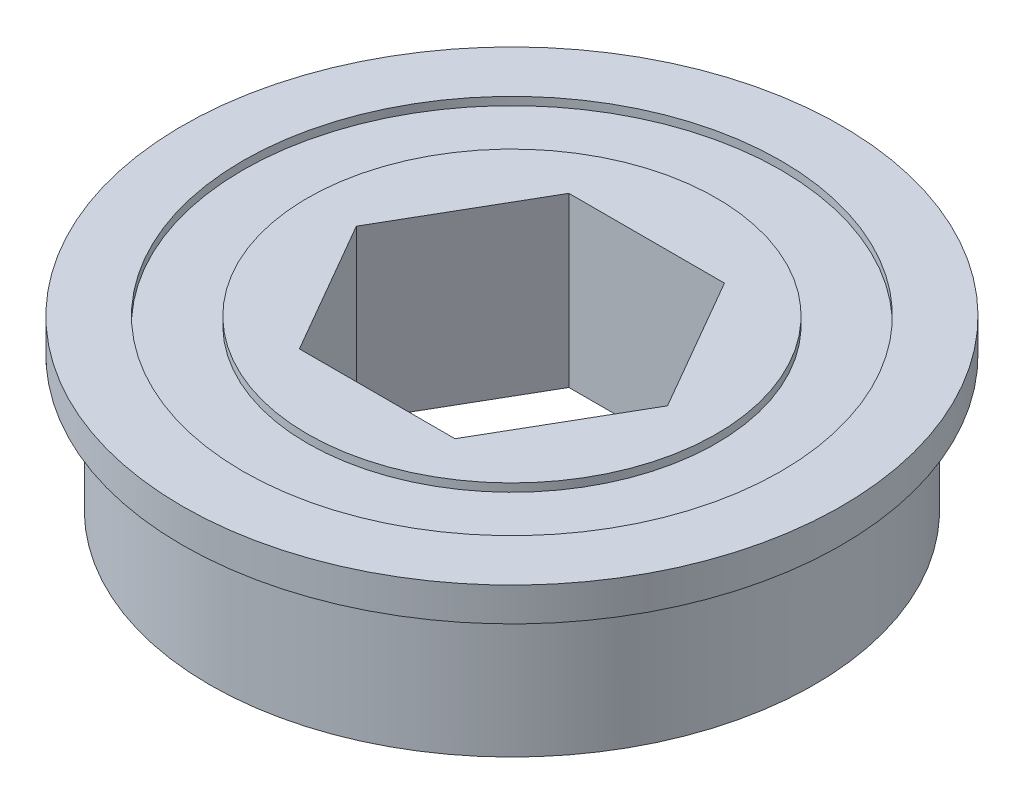
ISO-10303-21;
HEADER;
FILE_DESCRIPTION(('STEP AP214'),'2;1');
FILE_NAME('part.step','',(''),(''),'','','');
FILE_SCHEMA(('AUTOMOTIVE_DESIGN { 1 0 10303 214 1 1 1 1 }'));
ENDSEC;
DATA;
#1=APPLICATION_CONTEXT('core data for automotive mechanical design processes');
#2=APPLICATION_PROTOCOL_DEFINITION('international standard','automotive_design',2000,#1);
#3=PRODUCT_CONTEXT('',#1,'mechanical');
#4=PRODUCT('Part','Part','',(#3));
#5=PRODUCT_RELATED_PRODUCT_CATEGORY('part','',(#4));
#6=PRODUCT_DEFINITION_FORMATION('','',#4);
#7=PRODUCT_DEFINITION_CONTEXT('part definition',#1,'design');
#8=PRODUCT_DEFINITION('design','',#6,#7);
#9=PRODUCT_DEFINITION_SHAPE('','',#8);
#10=(LENGTH_UNIT() NAMED_UNIT(*) SI_UNIT(.MILLI.,.METRE.));
#11=(NAMED_UNIT(*) PLANE_ANGLE_UNIT() SI_UNIT($,.RADIAN.));
#12=(NAMED_UNIT(*) SI_UNIT($,.STERADIAN.) SOLID_ANGLE_UNIT());
#13=UNCERTAINTY_MEASURE_WITH_UNIT(LENGTH_MEASURE(1.E-05),#10,'distance_accuracy_value','');
#14=(GEOMETRIC_REPRESENTATION_CONTEXT(3) GLOBAL_UNCERTAINTY_ASSIGNED_CONTEXT((#13)) GLOBAL_UNIT_ASSIGNED_CONTEXT((#10,
#11,#12)) REPRESENTATION_CONTEXT('',''));
#15=CARTESIAN_POINT('',(0.,0.,0.));
#16=DIRECTION('',(0.,0.,1.));
#17=DIRECTION('',(1.,0.,0.));
#18=AXIS2_PLACEMENT_3D('',#15,#16,#17);
#19=CARTESIAN_POINT('',(0.,0.,0.));
#20=DIRECTION('',(0.,1.,0.));
#21=DIRECTION('',(0.,0.,1.));
#22=AXIS2_PLACEMENT_3D('',#19,#20,#21);
#23=CYLINDRICAL_SURFACE('',#22,12.7);
#24=CARTESIAN_POINT('',(0.,0.381,0.));
#25=DIRECTION('',(0.,1.,0.));
#26=DIRECTION('',(0.,0.,1.));
#27=AXIS2_PLACEMENT_3D('',#24,#25,#26);
#28=CIRCLE('',#27,12.7);
#29=CARTESIAN_POINT('',(0.,0.381,12.7));
#30=VERTEX_POINT('',#29);
#31=EDGE_CURVE('E128',#30,#30,#28,.F.);
#32=ORIENTED_EDGE('',*,*,#31,.F.);
#33=EDGE_LOOP('',(#32));
#34=FACE_BOUND('',#33,.T.);
#35=CARTESIAN_POINT('',(0.,0.,0.));
#36=DIRECTION('',(0.,1.,0.));
#37=DIRECTION('',(0.,0.,1.));
#38=AXIS2_PLACEMENT_3D('',#35,#36,#37);
#39=CIRCLE('',#38,12.7);
#40=CARTESIAN_POINT('',(0.,0.,12.7));
#41=VERTEX_POINT('',#40);
#42=EDGE_CURVE('E125',#41,#41,#39,.T.);
#43=ORIENTED_EDGE('',*,*,#42,.F.);
#44=EDGE_LOOP('',(#43));
#45=FACE_BOUND('',#44,.T.);
#46=ADVANCED_FACE('F16',(#34,#45),#23,.F.);
#47=CARTESIAN_POINT('',(9.652,0.381,0.));
#48=DIRECTION('',(0.,-1.,0.));
#49=DIRECTION('',(0.,0.,-1.));
#50=AXIS2_PLACEMENT_3D('',#47,#48,#49);
#51=PLANE('',#50);
#52=ORIENTED_EDGE('',*,*,#31,.T.);
#53=EDGE_LOOP('',(#52));
#54=FACE_BOUND('',#53,.T.);
#55=CARTESIAN_POINT('',(0.,0.381,0.));
#56=DIRECTION('',(0.,1.,0.));
#57=DIRECTION('',(0.,0.,1.));
#58=AXIS2_PLACEMENT_3D('',#55,#56,#57);
#59=CIRCLE('',#58,9.652);
#60=CARTESIAN_POINT('',(0.,0.381,9.652));
#61=VERTEX_POINT('',#60);
#62=EDGE_CURVE('E122',#61,#61,#59,.F.);
#63=ORIENTED_EDGE('',*,*,#62,.F.);
#64=EDGE_LOOP('',(#63));
#65=FACE_BOUND('',#64,.T.);
#66=ADVANCED_FACE('F357',(#54,#65),#51,.T.);
#67=CARTESIAN_POINT('',(14.2748,0.,0.));
#68=DIRECTION('',(0.,-1.,0.));
#69=DIRECTION('',(0.,0.,-1.));
#70=AXIS2_PLACEMENT_3D('',#67,#68,#69);
#71=PLANE('',#70);
#72=CARTESIAN_POINT('',(0.,0.,0.));
#73=DIRECTION('',(0.,1.,0.));
#74=DIRECTION('',(0.,0.,1.));
#75=AXIS2_PLACEMENT_3D('',#72,#73,#74);
#76=CIRCLE('',#75,14.2748);
#77=CARTESIAN_POINT('',(0.,0.,14.2748));
#78=VERTEX_POINT('',#77);
#79=EDGE_CURVE('E119',#78,#78,#76,.T.);
#80=ORIENTED_EDGE('',*,*,#79,.F.);
#81=EDGE_LOOP('',(#80));
#82=FACE_BOUND('',#81,.T.);
#83=ORIENTED_EDGE('',*,*,#42,.T.);
#84=EDGE_LOOP('',(#83));
#85=FACE_BOUND('',#84,.T.);
#86=ADVANCED_FACE('F347',(#82,#85),#71,.T.);
#87=CARTESIAN_POINT('',(0.,0.,0.));
#88=DIRECTION('',(0.,1.,0.));
#89=DIRECTION('',(0.,0.,1.));
#90=AXIS2_PLACEMENT_3D('',#87,#88,#89);
#91=CYLINDRICAL_SURFACE('',#90,9.652);
#92=CARTESIAN_POINT('',(0.,0.,0.));
#93=DIRECTION('',(0.,1.,0.));
#94=DIRECTION('',(0.,0.,1.));
#95=AXIS2_PLACEMENT_3D('',#92,#93,#94);
#96=CIRCLE('',#95,9.652);
#97=CARTESIAN_POINT('',(0.,0.,9.652));
#98=VERTEX_POINT('',#97);
#99=EDGE_CURVE('E99',#98,#98,#96,.F.);
#100=ORIENTED_EDGE('',*,*,#99,.F.);
#101=EDGE_LOOP('',(#100));
#102=FACE_BOUND('',#101,.T.);
#103=ORIENTED_EDGE('',*,*,#62,.T.);
#104=EDGE_LOOP('',(#103));
#105=FACE_BOUND('',#104,.T.);
#106=ADVANCED_FACE('F337',(#102,#105),#91,.T.);
#107=CARTESIAN_POINT('',(0.,0.,0.));
#108=DIRECTION('',(0.,1.,0.));
#109=DIRECTION('',(0.,0.,1.));
#110=AXIS2_PLACEMENT_3D('',#107,#108,#109);
#111=CYLINDRICAL_SURFACE('',#110,14.2748);
#112=ORIENTED_EDGE('',*,*,#79,.T.);
#113=EDGE_LOOP('',(#112));
#114=FACE_BOUND('',#113,.T.);
#115=CARTESIAN_POINT('',(0.,5.6,0.));
#116=DIRECTION('',(0.,-1.,0.));
#117=DIRECTION('',(0.,0.,-1.));
#118=AXIS2_PLACEMENT_3D('',#115,#116,#117);
#119=CIRCLE('',#118,14.2748);
#120=CARTESIAN_POINT('',(0.,5.6,-14.2748));
#121=VERTEX_POINT('',#120);
#122=EDGE_CURVE('E82',#121,#121,#119,.F.);
#123=ORIENTED_EDGE('',*,*,#122,.F.);
#124=EDGE_LOOP('',(#123));
#125=FACE_BOUND('',#124,.T.);
#126=ADVANCED_FACE('F327',(#114,#125),#111,.T.);
#127=CARTESIAN_POINT('',(9.652,0.,0.));
#128=DIRECTION('',(0.,-1.,0.));
#129=DIRECTION('',(0.,0.,-1.));
#130=AXIS2_PLACEMENT_3D('',#127,#128,#129);
#131=PLANE('',#130);
#132=ORIENTED_EDGE('',*,*,#99,.T.);
#133=EDGE_LOOP('',(#132));
#134=FACE_BOUND('',#133,.T.);
#135=DIRECTION('',(1.,0.,0.));
#136=VECTOR('',#135,1.);
#137=CARTESIAN_POINT('',(-3.67194771204601,0.,6.36));
#138=LINE('',#137,#136);
#139=CARTESIAN_POINT('',(-3.67194771204601,0.,6.36));
#140=VERTEX_POINT('',#139);
#141=CARTESIAN_POINT('',(3.67194771204602,0.,6.36));
#142=VERTEX_POINT('',#141);
#143=EDGE_CURVE('E61',#140,#142,#138,.T.);
#144=ORIENTED_EDGE('',*,*,#143,.T.);
#145=DIRECTION('',(0.5,0.,-0.866025403784439));
#146=VECTOR('',#145,1.);
#147=CARTESIAN_POINT('',(3.67194771204602,0.,6.36));
#148=LINE('',#147,#146);
#149=CARTESIAN_POINT('',(7.34389542409204,0.,0.));
#150=VERTEX_POINT('',#149);
#151=EDGE_CURVE('E63',#142,#150,#148,.T.);
#152=ORIENTED_EDGE('',*,*,#151,.T.);
#153=DIRECTION('',(-0.5,0.,-0.866025403784439));
#154=VECTOR('',#153,1.);
#155=CARTESIAN_POINT('',(7.34389542409204,0.,0.));
#156=LINE('',#155,#154);
#157=CARTESIAN_POINT('',(3.67194771204602,0.,-6.36));
#158=VERTEX_POINT('',#157);
#159=EDGE_CURVE('E66',#150,#158,#156,.T.);
#160=ORIENTED_EDGE('',*,*,#159,.T.);
#161=DIRECTION('',(-1.,0.,0.));
#162=VECTOR('',#161,1.);
#163=CARTESIAN_POINT('',(3.67194771204602,0.,-6.36));
#164=LINE('',#163,#162);
#165=CARTESIAN_POINT('',(-3.67194771204602,0.,-6.36));
#166=VERTEX_POINT('',#165);
#167=EDGE_CURVE('E191',#158,#166,#164,.T.);
#168=ORIENTED_EDGE('',*,*,#167,.T.);
#169=DIRECTION('',(-0.5,0.,0.866025403784439));
#170=VECTOR('',#169,1.);
#171=CARTESIAN_POINT('',(-3.67194771204602,0.,-6.36));
#172=LINE('',#171,#170);
#173=CARTESIAN_POINT('',(-7.34389542409204,0.,0.));
#174=VERTEX_POINT('',#173);
#175=EDGE_CURVE('E197',#166,#174,#172,.T.);
#176=ORIENTED_EDGE('',*,*,#175,.T.);
#177=DIRECTION('',(0.5,0.,0.866025403784439));
#178=VECTOR('',#177,1.);
#179=CARTESIAN_POINT('',(-7.34389542409204,0.,0.));
#180=LINE('',#179,#178);
#181=EDGE_CURVE('E202',#174,#140,#180,.T.);
#182=ORIENTED_EDGE('',*,*,#181,.T.);
#183=EDGE_LOOP('',(#144,#152,#160,#168,#176,#182));
#184=FACE_BOUND('',#183,.T.);
#185=ADVANCED_FACE('F65',(#134,#184),#131,.T.);
#186=CARTESIAN_POINT('',(0.,5.6,0.));
#187=DIRECTION('',(0.,-1.,0.));
#188=DIRECTION('',(0.,0.,-1.));
#189=AXIS2_PLACEMENT_3D('',#186,#187,#188);
#190=CONICAL_SURFACE('',#189,14.2748,0.523598775598298);
#191=CARTESIAN_POINT('',(0.,5.975,0.));
#192=DIRECTION('',(0.,1.,0.));
#193=DIRECTION('',(0.,0.,1.));
#194=AXIS2_PLACEMENT_3D('',#191,#192,#193);
#195=CIRCLE('',#194,14.0582936490539);
#196=CARTESIAN_POINT('',(0.,5.975,14.0582936490539));
#197=VERTEX_POINT('',#196);
#198=EDGE_CURVE('E93',#197,#197,#195,.F.);
#199=ORIENTED_EDGE('',*,*,#198,.T.);
#200=EDGE_LOOP('',(#199));
#201=FACE_BOUND('',#200,.T.);
#202=ORIENTED_EDGE('',*,*,#122,.T.);
#203=EDGE_LOOP('',(#202));
#204=FACE_BOUND('',#203,.T.);
#205=ADVANCED_FACE('F309',(#201,#204),#190,.T.);
#206=CARTESIAN_POINT('',(7.34389542409204,0.,0.));
#207=DIRECTION('',(0.866025403784439,0.,-0.5));
#208=DIRECTION('',(-0.5,0.,-0.866025403784439));
#209=AXIS2_PLACEMENT_3D('',#206,#207,#208);
#210=PLANE('',#209);
#211=DIRECTION('',(0.,1.,0.));
#212=VECTOR('',#211,1.);
#213=CARTESIAN_POINT('',(3.67194771204602,0.,-6.36));
#214=LINE('',#213,#212);
#215=CARTESIAN_POINT('',(3.67194771204602,7.9375,-6.36));
#216=VERTEX_POINT('',#215);
#217=EDGE_CURVE('E80',#216,#158,#214,.F.);
#218=ORIENTED_EDGE('',*,*,#217,.T.);
#219=ORIENTED_EDGE('',*,*,#159,.F.);
#220=DIRECTION('',(0.,1.,0.));
#221=VECTOR('',#220,1.);
#222=CARTESIAN_POINT('',(7.34389542409204,0.,0.));
#223=LINE('',#222,#221);
#224=CARTESIAN_POINT('',(7.34389542409204,7.9375,0.));
#225=VERTEX_POINT('',#224);
#226=EDGE_CURVE('E72',#150,#225,#223,.T.);
#227=ORIENTED_EDGE('',*,*,#226,.T.);
#228=DIRECTION('',(0.5,0.,0.866025403784438));
#229=VECTOR('',#228,1.);
#230=CARTESIAN_POINT('',(3.67194771204602,7.9375,-6.36));
#231=LINE('',#230,#229);
#232=EDGE_CURVE('E96',#216,#225,#231,.T.);
#233=ORIENTED_EDGE('',*,*,#232,.F.);
#234=EDGE_LOOP('',(#218,#219,#227,#233));
#235=FACE_BOUND('',#234,.T.);
#236=ADVANCED_FACE('F76',(#235),#210,.F.);
#237=CARTESIAN_POINT('',(3.67194771204602,0.,6.36));
#238=DIRECTION('',(0.866025403784439,0.,0.5));
#239=DIRECTION('',(0.5,0.,-0.866025403784439));
#240=AXIS2_PLACEMENT_3D('',#237,#238,#239);
#241=PLANE('',#240);
#242=ORIENTED_EDGE('',*,*,#226,.F.);
#243=ORIENTED_EDGE('',*,*,#151,.F.);
#244=DIRECTION('',(0.,1.,0.));
#245=VECTOR('',#244,1.);
#246=CARTESIAN_POINT('',(3.67194771204602,0.,6.36));
#247=LINE('',#246,#245);
#248=CARTESIAN_POINT('',(3.67194771204602,7.9375,6.36));
#249=VERTEX_POINT('',#248);
#250=EDGE_CURVE('E89',#142,#249,#247,.T.);
#251=ORIENTED_EDGE('',*,*,#250,.T.);
#252=DIRECTION('',(-0.5,0.,0.866025403784439));
#253=VECTOR('',#252,1.);
#254=CARTESIAN_POINT('',(7.34389542409204,7.9375,0.));
#255=LINE('',#254,#253);
#256=EDGE_CURVE('E86',#225,#249,#255,.T.);
#257=ORIENTED_EDGE('',*,*,#256,.F.);
#258=EDGE_LOOP('',(#242,#243,#251,#257));
#259=FACE_BOUND('',#258,.T.);
#260=ADVANCED_FACE('F84',(#259),#241,.F.);
#261=CARTESIAN_POINT('',(-3.67194771204601,0.,6.36));
#262=DIRECTION('',(0.,0.,1.));
#263=DIRECTION('',(1.,0.,0.));
#264=AXIS2_PLACEMENT_3D('',#261,#262,#263);
#265=PLANE('',#264);
#266=ORIENTED_EDGE('',*,*,#250,.F.);
#267=ORIENTED_EDGE('',*,*,#143,.F.);
#268=DIRECTION('',(0.,1.,0.));
#269=VECTOR('',#268,1.);
#270=CARTESIAN_POINT('',(-3.67194771204601,0.,6.36));
#271=LINE('',#270,#269);
#272=CARTESIAN_POINT('',(-3.67194771204601,7.9375,6.36));
#273=VERTEX_POINT('',#272);
#274=EDGE_CURVE('E199',#140,#273,#271,.T.);
#275=ORIENTED_EDGE('',*,*,#274,.T.);
#276=DIRECTION('',(1.,0.,0.));
#277=VECTOR('',#276,1.);
#278=CARTESIAN_POINT('',(6.35,7.9375,6.36));
#279=LINE('',#278,#277);
#280=EDGE_CURVE('E184',#249,#273,#279,.F.);
#281=ORIENTED_EDGE('',*,*,#280,.F.);
#282=EDGE_LOOP('',(#266,#267,#275,#281));
#283=FACE_BOUND('',#282,.T.);
#284=ADVANCED_FACE('F208',(#283),#265,.F.);
#285=CARTESIAN_POINT('',(-7.34389542409204,0.,0.));
#286=DIRECTION('',(-0.866025403784439,0.,0.5));
#287=DIRECTION('',(0.5,0.,0.866025403784439));
#288=AXIS2_PLACEMENT_3D('',#285,#286,#287);
#289=PLANE('',#288);
#290=ORIENTED_EDGE('',*,*,#274,.F.);
#291=ORIENTED_EDGE('',*,*,#181,.F.);
#292=DIRECTION('',(0.,1.,0.));
#293=VECTOR('',#292,1.);
#294=CARTESIAN_POINT('',(-7.34389542409204,0.,0.));
#295=LINE('',#294,#293);
#296=CARTESIAN_POINT('',(-7.34389542409204,7.9375,0.));
#297=VERTEX_POINT('',#296);
#298=EDGE_CURVE('E194',#174,#297,#295,.T.);
#299=ORIENTED_EDGE('',*,*,#298,.T.);
#300=DIRECTION('',(-0.5,0.,-0.866025403784439));
#301=VECTOR('',#300,1.);
#302=CARTESIAN_POINT('',(-3.67194771204601,7.9375,6.36));
#303=LINE('',#302,#301);
#304=EDGE_CURVE('E181',#273,#297,#303,.T.);
#305=ORIENTED_EDGE('',*,*,#304,.F.);
#306=EDGE_LOOP('',(#290,#291,#299,#305));
#307=FACE_BOUND('',#306,.T.);
#308=ADVANCED_FACE('F224',(#307),#289,.F.);
#309=CARTESIAN_POINT('',(-3.67194771204602,0.,-6.36));
#310=DIRECTION('',(-0.866025403784439,0.,-0.5));
#311=DIRECTION('',(-0.5,0.,0.866025403784439));
#312=AXIS2_PLACEMENT_3D('',#309,#310,#311);
#313=PLANE('',#312);
#314=ORIENTED_EDGE('',*,*,#298,.F.);
#315=ORIENTED_EDGE('',*,*,#175,.F.);
#316=DIRECTION('',(0.,1.,0.));
#317=VECTOR('',#316,1.);
#318=CARTESIAN_POINT('',(-3.67194771204602,0.,-6.36));
#319=LINE('',#318,#317);
#320=CARTESIAN_POINT('',(-3.67194771204602,7.9375,-6.36));
#321=VERTEX_POINT('',#320);
#322=EDGE_CURVE('E97',#166,#321,#319,.T.);
#323=ORIENTED_EDGE('',*,*,#322,.T.);
#324=DIRECTION('',(0.5,0.,-0.866025403784439));
#325=VECTOR('',#324,1.);
#326=CARTESIAN_POINT('',(-7.34389542409204,7.9375,0.));
#327=LINE('',#326,#325);
#328=EDGE_CURVE('E178',#297,#321,#327,.T.);
#329=ORIENTED_EDGE('',*,*,#328,.F.);
#330=EDGE_LOOP('',(#314,#315,#323,#329));
#331=FACE_BOUND('',#330,.T.);
#332=ADVANCED_FACE('F220',(#331),#313,.F.);
#333=CARTESIAN_POINT('',(3.67194771204602,0.,-6.36));
#334=DIRECTION('',(0.,0.,-1.));
#335=DIRECTION('',(-1.,0.,0.));
#336=AXIS2_PLACEMENT_3D('',#333,#334,#335);
#337=PLANE('',#336);
#338=ORIENTED_EDGE('',*,*,#322,.F.);
#339=ORIENTED_EDGE('',*,*,#167,.F.);
#340=ORIENTED_EDGE('',*,*,#217,.F.);
#341=DIRECTION('',(1.,0.,0.));
#342=VECTOR('',#341,1.);
#343=CARTESIAN_POINT('',(6.35,7.9375,-6.36));
#344=LINE('',#343,#342);
#345=EDGE_CURVE('E116',#321,#216,#344,.T.);
#346=ORIENTED_EDGE('',*,*,#345,.F.);
#347=EDGE_LOOP('',(#338,#339,#340,#346));
#348=FACE_BOUND('',#347,.T.);
#349=ADVANCED_FACE('F215',(#348),#337,.F.);
#350=CARTESIAN_POINT('',(6.35,7.9375,0.));
#351=DIRECTION('',(0.,1.,0.));
#352=DIRECTION('',(0.,0.,1.));
#353=AXIS2_PLACEMENT_3D('',#350,#351,#352);
#354=PLANE('',#353);
#355=CARTESIAN_POINT('',(0.,7.9375,0.));
#356=DIRECTION('',(0.,1.,0.));
#357=DIRECTION('',(0.,0.,1.));
#358=AXIS2_PLACEMENT_3D('',#355,#356,#357);
#359=CIRCLE('',#358,9.652);
#360=CARTESIAN_POINT('',(0.,7.9375,9.652));
#361=VERTEX_POINT('',#360);
#362=EDGE_CURVE('E112',#361,#361,#359,.F.);
#363=ORIENTED_EDGE('',*,*,#362,.F.);
#364=EDGE_LOOP('',(#363));
#365=FACE_BOUND('',#364,.T.);
#366=ORIENTED_EDGE('',*,*,#328,.T.);
#367=ORIENTED_EDGE('',*,*,#345,.T.);
#368=ORIENTED_EDGE('',*,*,#232,.T.);
#369=ORIENTED_EDGE('',*,*,#256,.T.);
#370=ORIENTED_EDGE('',*,*,#280,.T.);
#371=ORIENTED_EDGE('',*,*,#304,.T.);
#372=EDGE_LOOP('',(#366,#367,#368,#369,#370,#371));
#373=FACE_BOUND('',#372,.T.);
#374=ADVANCED_FACE('F163',(#365,#373),#354,.T.);
#375=CARTESIAN_POINT('',(0.,6.1,0.));
#376=DIRECTION('',(0.,1.,0.));
#377=DIRECTION('',(0.,0.,1.));
#378=AXIS2_PLACEMENT_3D('',#375,#376,#377);
#379=TOROIDAL_SURFACE('',#378,14.2748,0.25);
#380=ORIENTED_EDGE('',*,*,#198,.F.);
#381=EDGE_LOOP('',(#380));
#382=FACE_BOUND('',#381,.T.);
#383=CARTESIAN_POINT('',(0.,6.35,0.));
#384=DIRECTION('',(0.,-1.,0.));
#385=DIRECTION('',(0.,0.,-1.));
#386=AXIS2_PLACEMENT_3D('',#383,#384,#385);
#387=CIRCLE('',#386,14.2748);
#388=CARTESIAN_POINT('',(0.,6.35,14.2748));
#389=VERTEX_POINT('',#388);
#390=CARTESIAN_POINT('',(0.,6.35,-14.2748));
#391=VERTEX_POINT('',#390);
#392=EDGE_CURVE('E115',#389,#391,#387,.F.);
#393=ORIENTED_EDGE('',*,*,#392,.F.);
#394=CARTESIAN_POINT('',(0.,6.35,0.));
#395=DIRECTION('',(0.,-1.,0.));
#396=DIRECTION('',(0.,0.,1.));
#397=AXIS2_PLACEMENT_3D('',#394,#395,#396);
#398=CIRCLE('',#397,14.2748);
#399=EDGE_CURVE('E35',#391,#389,#398,.F.);
#400=ORIENTED_EDGE('',*,*,#399,.F.);
#401=EDGE_LOOP('',(#393,#400));
#402=FACE_BOUND('',#401,.T.);
#403=ADVANCED_FACE('F130',(#382,#402),#379,.F.);
#404=CARTESIAN_POINT('',(0.,0.,0.));
#405=DIRECTION('',(0.,1.,0.));
#406=DIRECTION('',(0.,0.,1.));
#407=AXIS2_PLACEMENT_3D('',#404,#405,#406);
#408=CYLINDRICAL_SURFACE('',#407,9.652);
#409=CARTESIAN_POINT('',(0.,7.5565,0.));
#410=DIRECTION('',(0.,1.,0.));
#411=DIRECTION('',(0.,0.,1.));
#412=AXIS2_PLACEMENT_3D('',#409,#410,#411);
#413=CIRCLE('',#412,9.652);
#414=CARTESIAN_POINT('',(0.,7.5565,9.652));
#415=VERTEX_POINT('',#414);
#416=EDGE_CURVE('E109',#415,#415,#413,.F.);
#417=ORIENTED_EDGE('',*,*,#416,.F.);
#418=EDGE_LOOP('',(#417));
#419=FACE_BOUND('',#418,.T.);
#420=ORIENTED_EDGE('',*,*,#362,.T.);
#421=EDGE_LOOP('',(#420));
#422=FACE_BOUND('',#421,.T.);
#423=ADVANCED_FACE('F154',(#419,#422),#408,.T.);
#424=CARTESIAN_POINT('',(15.5575,6.35,0.));
#425=DIRECTION('',(0.,-1.,0.));
#426=DIRECTION('',(0.,0.,-1.));
#427=AXIS2_PLACEMENT_3D('',#424,#425,#426);
#428=PLANE('',#427);
#429=CARTESIAN_POINT('',(0.,6.35,0.));
#430=DIRECTION('',(0.,1.,0.));
#431=DIRECTION('',(0.,0.,1.));
#432=AXIS2_PLACEMENT_3D('',#429,#430,#431);
#433=CIRCLE('',#432,15.5575);
#434=CARTESIAN_POINT('',(0.,6.35,15.5575));
#435=VERTEX_POINT('',#434);
#436=EDGE_CURVE('E106',#435,#435,#433,.T.);
#437=ORIENTED_EDGE('',*,*,#436,.F.);
#438=EDGE_LOOP('',(#437));
#439=FACE_BOUND('',#438,.T.);
#440=ORIENTED_EDGE('',*,*,#392,.T.);
#441=ORIENTED_EDGE('',*,*,#399,.T.);
#442=EDGE_LOOP('',(#440,#441));
#443=FACE_BOUND('',#442,.T.);
#444=ADVANCED_FACE('F134',(#439,#443),#428,.T.);
#445=CARTESIAN_POINT('',(9.652,7.5565,0.));
#446=DIRECTION('',(0.,1.,0.));
#447=DIRECTION('',(0.,0.,1.));
#448=AXIS2_PLACEMENT_3D('',#445,#446,#447);
#449=PLANE('',#448);
#450=ORIENTED_EDGE('',*,*,#416,.T.);
#451=EDGE_LOOP('',(#450));
#452=FACE_BOUND('',#451,.T.);
#453=CARTESIAN_POINT('',(0.,7.5565,0.));
#454=DIRECTION('',(0.,1.,0.));
#455=DIRECTION('',(0.,0.,1.));
#456=AXIS2_PLACEMENT_3D('',#453,#454,#455);
#457=CIRCLE('',#456,12.7);
#458=CARTESIAN_POINT('',(0.,7.5565,12.7));
#459=VERTEX_POINT('',#458);
#460=EDGE_CURVE('E103',#459,#459,#457,.T.);
#461=ORIENTED_EDGE('',*,*,#460,.T.);
#462=EDGE_LOOP('',(#461));
#463=FACE_BOUND('',#462,.T.);
#464=ADVANCED_FACE('F153',(#452,#463),#449,.T.);
#465=CARTESIAN_POINT('',(0.,0.,0.));
#466=DIRECTION('',(0.,1.,0.));
#467=DIRECTION('',(0.,0.,1.));
#468=AXIS2_PLACEMENT_3D('',#465,#466,#467);
#469=CYLINDRICAL_SURFACE('',#468,15.5575);
#470=ORIENTED_EDGE('',*,*,#436,.T.);
#471=EDGE_LOOP('',(#470));
#472=FACE_BOUND('',#471,.T.);
#473=CARTESIAN_POINT('',(0.,7.9375,0.));
#474=DIRECTION('',(0.,1.,0.));
#475=DIRECTION('',(0.,0.,1.));
#476=AXIS2_PLACEMENT_3D('',#473,#474,#475);
#477=CIRCLE('',#476,15.5575);
#478=CARTESIAN_POINT('',(0.,7.9375,15.5575));
#479=VERTEX_POINT('',#478);
#480=EDGE_CURVE('E27',#479,#479,#477,.T.);
#481=ORIENTED_EDGE('',*,*,#480,.F.);
#482=EDGE_LOOP('',(#481));
#483=FACE_BOUND('',#482,.T.);
#484=ADVANCED_FACE('F245',(#472,#483),#469,.T.);
#485=CARTESIAN_POINT('',(0.,0.,0.));
#486=DIRECTION('',(0.,1.,0.));
#487=DIRECTION('',(0.,0.,1.));
#488=AXIS2_PLACEMENT_3D('',#485,#486,#487);
#489=CYLINDRICAL_SURFACE('',#488,12.7);
#490=CARTESIAN_POINT('',(0.,7.9375,0.));
#491=DIRECTION('',(0.,1.,0.));
#492=DIRECTION('',(0.,0.,1.));
#493=AXIS2_PLACEMENT_3D('',#490,#491,#492);
#494=CIRCLE('',#493,12.7);
#495=CARTESIAN_POINT('',(0.,7.9375,12.7));
#496=VERTEX_POINT('',#495);
#497=EDGE_CURVE('E9',#496,#496,#494,.F.);
#498=ORIENTED_EDGE('',*,*,#497,.F.);
#499=EDGE_LOOP('',(#498));
#500=FACE_BOUND('',#499,.T.);
#501=ORIENTED_EDGE('',*,*,#460,.F.);
#502=EDGE_LOOP('',(#501));
#503=FACE_BOUND('',#502,.T.);
#504=ADVANCED_FACE('F239',(#500,#503),#489,.F.);
#505=CARTESIAN_POINT('',(12.7,7.9375,0.));
#506=DIRECTION('',(0.,1.,0.));
#507=DIRECTION('',(0.,0.,1.));
#508=AXIS2_PLACEMENT_3D('',#505,#506,#507);
#509=PLANE('',#508);
#510=ORIENTED_EDGE('',*,*,#497,.T.);
#511=EDGE_LOOP('',(#510));
#512=FACE_BOUND('',#511,.T.);
#513=ORIENTED_EDGE('',*,*,#480,.T.);
#514=EDGE_LOOP('',(#513));
#515=FACE_BOUND('',#514,.T.);
#516=ADVANCED_FACE('F237',(#512,#515),#509,.T.);
#517=CLOSED_SHELL('',(#46,#66,#86,#106,#126,#185,#205,#236,#260,#284,#308,#332,#349,#374,#403,
#423,#444,#464,#484,#504,#516));
#518=MANIFOLD_SOLID_BREP('B1',#517);
#519=ADVANCED_BREP_SHAPE_REPRESENTATION('',(#18,#518),#14);
#520=SHAPE_DEFINITION_REPRESENTATION(#9,#519);
ENDSEC;
END-ISO-10303-21;
